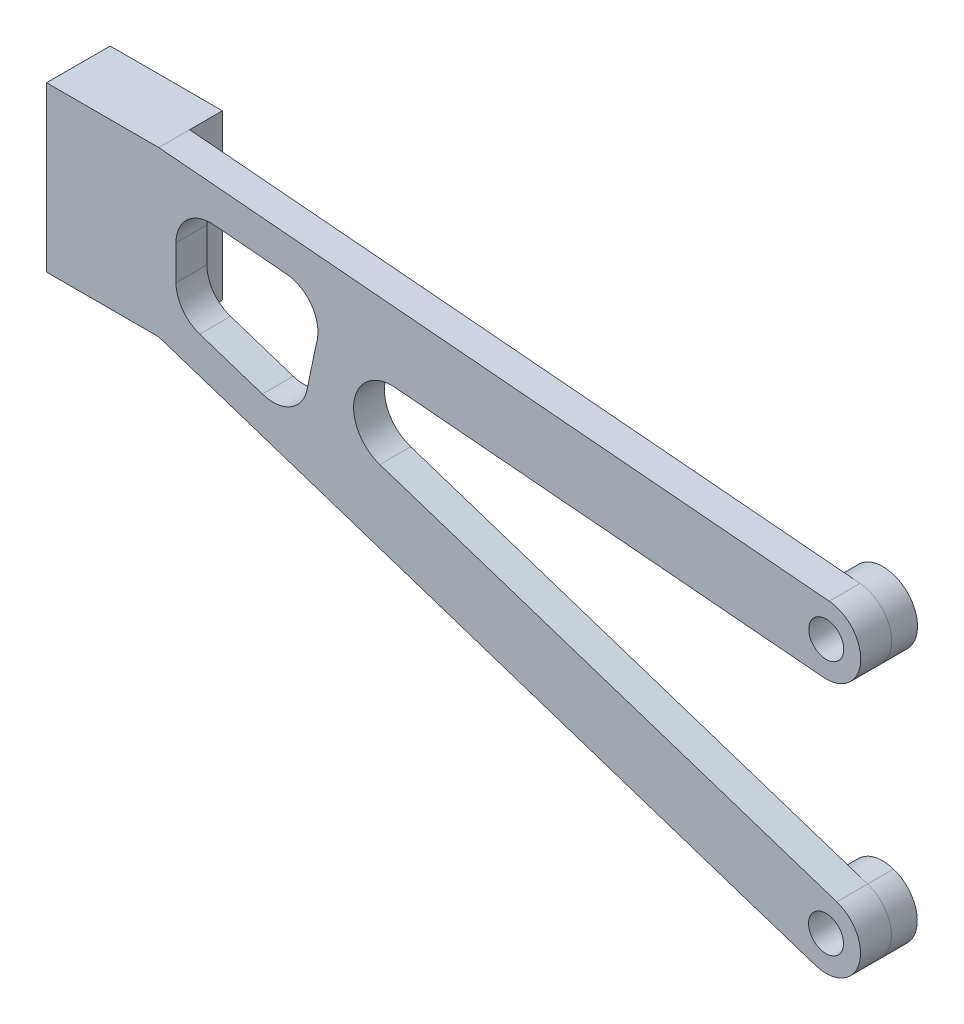
ISO-10303-21;
HEADER;
FILE_DESCRIPTION(('STEP AP214'),'2;1');
FILE_NAME('part.step','',(''),(''),'','','');
FILE_SCHEMA(('AUTOMOTIVE_DESIGN { 1 0 10303 214 1 1 1 1 }'));
ENDSEC;
DATA;
#1=APPLICATION_CONTEXT('core data for automotive mechanical design processes');
#2=APPLICATION_PROTOCOL_DEFINITION('international standard','automotive_design',2000,#1);
#3=PRODUCT_CONTEXT('',#1,'mechanical');
#4=PRODUCT('Part','Part','',(#3));
#5=PRODUCT_RELATED_PRODUCT_CATEGORY('part','',(#4));
#6=PRODUCT_DEFINITION_FORMATION('','',#4);
#7=PRODUCT_DEFINITION_CONTEXT('part definition',#1,'design');
#8=PRODUCT_DEFINITION('design','',#6,#7);
#9=PRODUCT_DEFINITION_SHAPE('','',#8);
#10=(LENGTH_UNIT() NAMED_UNIT(*) SI_UNIT(.MILLI.,.METRE.));
#11=(NAMED_UNIT(*) PLANE_ANGLE_UNIT() SI_UNIT($,.RADIAN.));
#12=(NAMED_UNIT(*) SI_UNIT($,.STERADIAN.) SOLID_ANGLE_UNIT());
#13=UNCERTAINTY_MEASURE_WITH_UNIT(LENGTH_MEASURE(1.E-05),#10,'distance_accuracy_value','');
#14=(GEOMETRIC_REPRESENTATION_CONTEXT(3) GLOBAL_UNCERTAINTY_ASSIGNED_CONTEXT((#13)) GLOBAL_UNIT_ASSIGNED_CONTEXT((#10,
#11,#12)) REPRESENTATION_CONTEXT('',''));
#15=CARTESIAN_POINT('',(0.,0.,0.));
#16=DIRECTION('',(0.,0.,1.));
#17=DIRECTION('',(1.,0.,0.));
#18=AXIS2_PLACEMENT_3D('',#15,#16,#17);
#19=CARTESIAN_POINT('',(90.3351419199884,8.33209639340714,0.));
#20=DIRECTION('',(0.,0.,-1.));
#21=DIRECTION('',(-1.,0.,0.));
#22=AXIS2_PLACEMENT_3D('',#19,#20,#21);
#23=PLANE('',#22);
#24=CARTESIAN_POINT('',(90.3351419199884,8.33209639340714,0.));
#25=DIRECTION('',(0.,0.,1.));
#26=DIRECTION('',(1.,0.,0.));
#27=AXIS2_PLACEMENT_3D('',#24,#25,#26);
#28=CIRCLE('',#27,2.02499999999999);
#29=CARTESIAN_POINT('',(92.3601419199884,8.33209639340714,0.));
#30=VERTEX_POINT('',#29);
#31=EDGE_CURVE('E503',#30,#30,#28,.T.);
#32=ORIENTED_EDGE('',*,*,#31,.T.);
#33=EDGE_LOOP('',(#32));
#34=FACE_BOUND('',#33,.T.);
#35=CARTESIAN_POINT('',(90.3350999999822,8.3321,0.));
#36=DIRECTION('',(0.,0.,-1.));
#37=DIRECTION('',(-1.,0.,0.));
#38=AXIS2_PLACEMENT_3D('',#35,#36,#37);
#39=CIRCLE('',#38,4.00000000000001);
#40=CARTESIAN_POINT('',(86.3350999999822,8.3321,0.));
#41=VERTEX_POINT('',#40);
#42=EDGE_CURVE('E43',#41,#41,#39,.T.);
#43=ORIENTED_EDGE('',*,*,#42,.T.);
#44=EDGE_LOOP('',(#43));
#45=FACE_BOUND('',#44,.T.);
#46=ADVANCED_FACE('F39',(#34,#45),#23,.T.);
#47=CARTESIAN_POINT('',(90.3098654104279,-21.2081872750437,0.));
#48=DIRECTION('',(0.,0.,1.));
#49=DIRECTION('',(1.,0.,0.));
#50=AXIS2_PLACEMENT_3D('',#47,#48,#49);
#51=CIRCLE('',#50,2.02499999999999);
#52=CARTESIAN_POINT('',(92.3348654104279,-21.2081872750437,0.));
#53=VERTEX_POINT('',#52);
#54=EDGE_CURVE('E492',#53,#53,#51,.T.);
#55=ORIENTED_EDGE('',*,*,#54,.T.);
#56=EDGE_LOOP('',(#55));
#57=FACE_BOUND('',#56,.T.);
#58=DIRECTION('',(-0.949969653728772,0.312342211355488,0.));
#59=VECTOR('',#58,1.);
#60=CARTESIAN_POINT('',(91.5592342558498,-17.4083086601286,0.));
#61=LINE('',#60,#59);
#62=CARTESIAN_POINT('',(91.5592342558498,-17.4083086601286,0.));
#63=VERTEX_POINT('',#62);
#64=CARTESIAN_POINT('',(91.5589688454041,-17.4082213850849,0.));
#65=VERTEX_POINT('',#64);
#66=EDGE_CURVE('E434',#63,#65,#61,.T.);
#67=ORIENTED_EDGE('',*,*,#66,.F.);
#68=CARTESIAN_POINT('',(90.3095999999822,-21.2081,0.));
#69=DIRECTION('',(0.,0.,-1.));
#70=DIRECTION('',(-1.,0.,0.));
#71=AXIS2_PLACEMENT_3D('',#68,#69,#70);
#72=CIRCLE('',#71,4.00000000000001);
#73=CARTESIAN_POINT('',(89.0604965711,-25.0080658714197,0.));
#74=VERTEX_POINT('',#73);
#75=EDGE_CURVE('E270',#63,#74,#72,.T.);
#76=ORIENTED_EDGE('',*,*,#75,.T.);
#77=DIRECTION('',(0.949969653728772,-0.312342211355488,0.));
#78=VECTOR('',#77,1.);
#79=CARTESIAN_POINT('',(13.,0.,0.));
#80=LINE('',#79,#78);
#81=CARTESIAN_POINT('',(89.0602311545602,-25.0079786149151,0.));
#82=VERTEX_POINT('',#81);
#83=EDGE_CURVE('E431',#82,#74,#80,.T.);
#84=ORIENTED_EDGE('',*,*,#83,.F.);
#85=EDGE_CURVE('E264',#82,#65,#72,.T.);
#86=ORIENTED_EDGE('',*,*,#85,.T.);
#87=EDGE_LOOP('',(#67,#76,#84,#86));
#88=FACE_BOUND('',#87,.T.);
#89=ADVANCED_FACE('F583',(#57,#88),#23,.T.);
#90=CARTESIAN_POINT('',(90.3351419199884,8.33209639340714,6.575));
#91=DIRECTION('',(0.,0.,-1.));
#92=DIRECTION('',(-1.,0.,0.));
#93=AXIS2_PLACEMENT_3D('',#90,#91,#92);
#94=PLANE('',#93);
#95=DIRECTION('',(-1.,0.,0.));
#96=VECTOR('',#95,1.);
#97=CARTESIAN_POINT('',(0.,19.,6.575));
#98=LINE('',#97,#96);
#99=CARTESIAN_POINT('',(13.,19.,6.575));
#100=VERTEX_POINT('',#99);
#101=CARTESIAN_POINT('',(0.,19.,6.575));
#102=VERTEX_POINT('',#101);
#103=EDGE_CURVE('E397',#100,#102,#98,.T.);
#104=ORIENTED_EDGE('',*,*,#103,.T.);
#105=DIRECTION('',(0.,-1.,0.));
#106=VECTOR('',#105,1.);
#107=CARTESIAN_POINT('',(0.,19.,6.575));
#108=LINE('',#107,#106);
#109=CARTESIAN_POINT('',(0.,0.,6.575));
#110=VERTEX_POINT('',#109);
#111=EDGE_CURVE('E214',#102,#110,#108,.T.);
#112=ORIENTED_EDGE('',*,*,#111,.T.);
#113=DIRECTION('',(1.,0.,0.));
#114=VECTOR('',#113,1.);
#115=CARTESIAN_POINT('',(0.,0.,6.575));
#116=LINE('',#115,#114);
#117=CARTESIAN_POINT('',(13.,0.,6.575));
#118=VERTEX_POINT('',#117);
#119=EDGE_CURVE('E402',#110,#118,#116,.T.);
#120=ORIENTED_EDGE('',*,*,#119,.T.);
#121=DIRECTION('',(0.949969653728772,-0.312342211355488,0.));
#122=VECTOR('',#121,1.);
#123=CARTESIAN_POINT('',(13.,0.,6.575));
#124=LINE('',#123,#122);
#125=CARTESIAN_POINT('',(89.0604965650059,-25.0080658899588,6.575));
#126=VERTEX_POINT('',#125);
#127=EDGE_CURVE('E405',#118,#126,#124,.T.);
#128=ORIENTED_EDGE('',*,*,#127,.T.);
#129=CARTESIAN_POINT('',(90.3098654104279,-21.2081872750437,6.575));
#130=DIRECTION('',(0.,0.,1.));
#131=DIRECTION('',(-1.,0.,0.));
#132=AXIS2_PLACEMENT_3D('',#129,#130,#131);
#133=CIRCLE('',#132,4.);
#134=CARTESIAN_POINT('',(91.5592342558498,-17.4083086601286,6.575));
#135=VERTEX_POINT('',#134);
#136=EDGE_CURVE('E408',#126,#135,#133,.T.);
#137=ORIENTED_EDGE('',*,*,#136,.T.);
#138=DIRECTION('',(-0.949969653728772,0.312342211355488,0.));
#139=VECTOR('',#138,1.);
#140=CARTESIAN_POINT('',(91.5592342558498,-17.4083086601286,6.575));
#141=LINE('',#140,#139);
#142=CARTESIAN_POINT('',(38.6172306352684,-0.00141316663960361,6.575));
#143=VERTEX_POINT('',#142);
#144=EDGE_CURVE('E411',#135,#143,#141,.T.);
#145=ORIENTED_EDGE('',*,*,#144,.T.);
#146=CARTESIAN_POINT('',(40.,4.2041949351286,6.575));
#147=DIRECTION('',(0.,0.,-1.));
#148=DIRECTION('',(1.,0.,0.));
#149=AXIS2_PLACEMENT_3D('',#146,#147,#148);
#150=CIRCLE('',#149,4.42709731333055);
#151=CARTESIAN_POINT('',(40.3794607710835,8.61499986676038,6.575));
#152=VERTEX_POINT('',#151);
#153=EDGE_CURVE('E414',#143,#152,#150,.T.);
#154=ORIENTED_EDGE('',*,*,#153,.T.);
#155=DIRECTION('',(0.996319850108173,-0.0857132211530312,0.));
#156=VECTOR('',#155,1.);
#157=CARTESIAN_POINT('',(40.3794607710835,8.61499986676038,6.575));
#158=LINE('',#157,#156);
#159=CARTESIAN_POINT('',(89.9922890353763,4.34681699297444,6.575));
#160=VERTEX_POINT('',#159);
#161=EDGE_CURVE('E417',#152,#160,#158,.T.);
#162=ORIENTED_EDGE('',*,*,#161,.T.);
#163=CARTESIAN_POINT('',(90.3351419199884,8.33209639340714,6.575));
#164=DIRECTION('',(0.,0.,1.));
#165=DIRECTION('',(-1.,0.,0.));
#166=AXIS2_PLACEMENT_3D('',#163,#164,#165);
#167=CIRCLE('',#166,4.00000000000001);
#168=CARTESIAN_POINT('',(90.6779948046005,12.3173757938398,6.575));
#169=VERTEX_POINT('',#168);
#170=EDGE_CURVE('E420',#160,#169,#167,.T.);
#171=ORIENTED_EDGE('',*,*,#170,.T.);
#172=DIRECTION('',(-0.996319850108173,0.0857132211530312,0.));
#173=VECTOR('',#172,1.);
#174=CARTESIAN_POINT('',(13.,19.,6.575));
#175=LINE('',#174,#173);
#176=EDGE_CURVE('E423',#169,#100,#175,.T.);
#177=ORIENTED_EDGE('',*,*,#176,.T.);
#178=EDGE_LOOP('',(#104,#112,#120,#128,#137,#145,#154,#162,#171,#177));
#179=FACE_BOUND('',#178,.T.);
#180=CARTESIAN_POINT('',(26.2467810472205,4.06588894625047,6.575));
#181=DIRECTION('',(0.,0.,1.));
#182=DIRECTION('',(1.,0.,0.));
#183=AXIS2_PLACEMENT_3D('',#180,#181,#182);
#184=CIRCLE('',#183,4.);
#185=CARTESIAN_POINT('',(24.9974122017985,0.266010331335376,6.575));
#186=VERTEX_POINT('',#185);
#187=CARTESIAN_POINT('',(30.16022559048,3.23827079345772,6.575));
#188=VERTEX_POINT('',#187);
#189=EDGE_CURVE('E510',#186,#188,#184,.T.);
#190=ORIENTED_EDGE('',*,*,#189,.F.);
#191=DIRECTION('',(0.949969653728772,-0.312342211355488,0.));
#192=VECTOR('',#191,1.);
#193=CARTESIAN_POINT('',(17.7506311545781,2.64869235555941,6.575));
#194=LINE('',#193,#192);
#195=CARTESIAN_POINT('',(17.750631154578,2.6486923555594,6.575));
#196=VERTEX_POINT('',#195);
#197=EDGE_CURVE('E364',#196,#186,#194,.T.);
#198=ORIENTED_EDGE('',*,*,#197,.F.);
#199=CARTESIAN_POINT('',(19.,6.4485709704745,6.575));
#200=DIRECTION('',(0.,0.,1.));
#201=DIRECTION('',(1.,0.,0.));
#202=AXIS2_PLACEMENT_3D('',#199,#200,#201);
#203=CIRCLE('',#202,4.);
#204=CARTESIAN_POINT('',(15.,6.4485709704745,6.575));
#205=VERTEX_POINT('',#204);
#206=EDGE_CURVE('E372',#205,#196,#203,.T.);
#207=ORIENTED_EDGE('',*,*,#206,.F.);
#208=DIRECTION('',(0.,-1.,0.));
#209=VECTOR('',#208,1.);
#210=CARTESIAN_POINT('',(15.,10.4542711098311,6.575));
#211=LINE('',#210,#209);
#212=CARTESIAN_POINT('',(15.,10.4542711098311,6.575));
#213=VERTEX_POINT('',#212);
#214=EDGE_CURVE('E528',#213,#205,#211,.T.);
#215=ORIENTED_EDGE('',*,*,#214,.F.);
#216=CARTESIAN_POINT('',(19.,10.4542711098311,6.575));
#217=DIRECTION('',(0.,0.,1.));
#218=DIRECTION('',(-1.,0.,0.));
#219=AXIS2_PLACEMENT_3D('',#216,#217,#218);
#220=CIRCLE('',#219,4.);
#221=CARTESIAN_POINT('',(19.3428528846121,14.4395505102638,6.575));
#222=VERTEX_POINT('',#221);
#223=EDGE_CURVE('E525',#222,#213,#220,.T.);
#224=ORIENTED_EDGE('',*,*,#223,.F.);
#225=DIRECTION('',(-0.996319850108173,0.0857132211530309,0.));
#226=VECTOR('',#225,1.);
#227=CARTESIAN_POINT('',(27.7870234358858,13.7131000056024,6.575));
#228=LINE('',#227,#226);
#229=CARTESIAN_POINT('',(27.7870234358858,13.7131000056024,6.575));
#230=VERTEX_POINT('',#229);
#231=EDGE_CURVE('E522',#230,#222,#228,.T.);
#232=ORIENTED_EDGE('',*,*,#231,.F.);
#233=CARTESIAN_POINT('',(27.4441705512737,9.72782060516968,6.575));
#234=DIRECTION('',(0.,0.,1.));
#235=DIRECTION('',(1.,0.,0.));
#236=AXIS2_PLACEMENT_3D('',#233,#234,#235);
#237=CIRCLE('',#236,4.);
#238=CARTESIAN_POINT('',(31.3576150945333,8.90020245237694,6.575));
#239=VERTEX_POINT('',#238);
#240=EDGE_CURVE('E519',#239,#230,#237,.T.);
#241=ORIENTED_EDGE('',*,*,#240,.F.);
#242=DIRECTION('',(0.206904538198186,0.978361135814887,0.));
#243=VECTOR('',#242,1.);
#244=CARTESIAN_POINT('',(30.16022559048,3.23827079345772,6.575));
#245=LINE('',#244,#243);
#246=EDGE_CURVE('E516',#188,#239,#245,.T.);
#247=ORIENTED_EDGE('',*,*,#246,.F.);
#248=EDGE_LOOP('',(#190,#198,#207,#215,#224,#232,#241,#247));
#249=FACE_BOUND('',#248,.T.);
#250=CARTESIAN_POINT('',(90.3351419199884,8.33209639340714,6.575));
#251=DIRECTION('',(0.,0.,1.));
#252=DIRECTION('',(1.,0.,0.));
#253=AXIS2_PLACEMENT_3D('',#250,#251,#252);
#254=CIRCLE('',#253,2.02499999999999);
#255=CARTESIAN_POINT('',(92.3601419199884,8.33209639340714,6.575));
#256=VERTEX_POINT('',#255);
#257=EDGE_CURVE('E506',#256,#256,#254,.T.);
#258=ORIENTED_EDGE('',*,*,#257,.F.);
#259=EDGE_LOOP('',(#258));
#260=FACE_BOUND('',#259,.T.);
#261=CARTESIAN_POINT('',(90.3098654104279,-21.2081872750437,6.575));
#262=DIRECTION('',(0.,0.,1.));
#263=DIRECTION('',(1.,0.,0.));
#264=AXIS2_PLACEMENT_3D('',#261,#262,#263);
#265=CIRCLE('',#264,2.02499999999999);
#266=CARTESIAN_POINT('',(92.3348654104279,-21.2081872750437,6.575));
#267=VERTEX_POINT('',#266);
#268=EDGE_CURVE('E497',#267,#267,#265,.T.);
#269=ORIENTED_EDGE('',*,*,#268,.F.);
#270=EDGE_LOOP('',(#269));
#271=FACE_BOUND('',#270,.T.);
#272=ADVANCED_FACE('F538',(#179,#249,#260,#271),#94,.F.);
#273=DIRECTION('',(-1.,0.,0.));
#274=VECTOR('',#273,1.);
#275=CARTESIAN_POINT('',(10.5,16.5,0.));
#276=LINE('',#275,#274);
#277=CARTESIAN_POINT('',(10.5,16.5,0.));
#278=VERTEX_POINT('',#277);
#279=CARTESIAN_POINT('',(0.,16.5,0.));
#280=VERTEX_POINT('',#279);
#281=EDGE_CURVE('E236',#278,#280,#276,.T.);
#282=ORIENTED_EDGE('',*,*,#281,.F.);
#283=DIRECTION('',(0.,1.,0.));
#284=VECTOR('',#283,1.);
#285=CARTESIAN_POINT('',(10.5,0.,0.));
#286=LINE('',#285,#284);
#287=CARTESIAN_POINT('',(10.5,0.,0.));
#288=VERTEX_POINT('',#287);
#289=EDGE_CURVE('E62',#288,#278,#286,.T.);
#290=ORIENTED_EDGE('',*,*,#289,.F.);
#291=DIRECTION('',(1.,0.,0.));
#292=VECTOR('',#291,1.);
#293=CARTESIAN_POINT('',(0.,0.,0.));
#294=LINE('',#293,#292);
#295=CARTESIAN_POINT('',(0.,0.,0.));
#296=VERTEX_POINT('',#295);
#297=EDGE_CURVE('E428',#296,#288,#294,.T.);
#298=ORIENTED_EDGE('',*,*,#297,.F.);
#299=DIRECTION('',(0.,-1.,0.));
#300=VECTOR('',#299,1.);
#301=CARTESIAN_POINT('',(0.,19.,0.));
#302=LINE('',#301,#300);
#303=EDGE_CURVE('E57',#280,#296,#302,.T.);
#304=ORIENTED_EDGE('',*,*,#303,.F.);
#305=EDGE_LOOP('',(#282,#290,#298,#304));
#306=FACE_BOUND('',#305,.T.);
#307=ADVANCED_FACE('F604',(#306),#23,.T.);
#308=CARTESIAN_POINT('',(0.,19.,6.575));
#309=DIRECTION('',(0.,-1.,0.));
#310=DIRECTION('',(0.,0.,-1.));
#311=AXIS2_PLACEMENT_3D('',#308,#309,#310);
#312=PLANE('',#311);
#313=DIRECTION('',(0.,0.,-1.));
#314=VECTOR('',#313,1.);
#315=CARTESIAN_POINT('',(13.,19.,3.));
#316=LINE('',#315,#314);
#317=CARTESIAN_POINT('',(13.,19.,3.));
#318=VERTEX_POINT('',#317);
#319=CARTESIAN_POINT('',(13.,19.,-0.8));
#320=VERTEX_POINT('',#319);
#321=EDGE_CURVE('E224',#318,#320,#316,.T.);
#322=ORIENTED_EDGE('',*,*,#321,.T.);
#323=DIRECTION('',(1.,0.,0.));
#324=VECTOR('',#323,1.);
#325=CARTESIAN_POINT('',(0.,19.,-0.8));
#326=LINE('',#325,#324);
#327=CARTESIAN_POINT('',(0.,19.,-0.8));
#328=VERTEX_POINT('',#327);
#329=EDGE_CURVE('E222',#328,#320,#326,.T.);
#330=ORIENTED_EDGE('',*,*,#329,.F.);
#331=DIRECTION('',(0.,0.,-1.));
#332=VECTOR('',#331,1.);
#333=CARTESIAN_POINT('',(0.,19.,6.575));
#334=LINE('',#333,#332);
#335=EDGE_CURVE('E207',#102,#328,#334,.T.);
#336=ORIENTED_EDGE('',*,*,#335,.F.);
#337=ORIENTED_EDGE('',*,*,#103,.F.);
#338=DIRECTION('',(0.,0.,-1.));
#339=VECTOR('',#338,1.);
#340=CARTESIAN_POINT('',(13.,19.,6.575));
#341=LINE('',#340,#339);
#342=EDGE_CURVE('E305',#100,#318,#341,.T.);
#343=ORIENTED_EDGE('',*,*,#342,.T.);
#344=EDGE_LOOP('',(#322,#330,#336,#337,#343));
#345=FACE_BOUND('',#344,.T.);
#346=ADVANCED_FACE('F41',(#345),#312,.F.);
#347=CARTESIAN_POINT('',(0.,19.,6.575));
#348=DIRECTION('',(1.,0.,0.));
#349=DIRECTION('',(0.,1.,0.));
#350=AXIS2_PLACEMENT_3D('',#347,#348,#349);
#351=PLANE('',#350);
#352=ORIENTED_EDGE('',*,*,#335,.T.);
#353=DIRECTION('',(0.,1.,0.));
#354=VECTOR('',#353,1.);
#355=CARTESIAN_POINT('',(0.,16.5,-0.8));
#356=LINE('',#355,#354);
#357=CARTESIAN_POINT('',(0.,16.5,-0.8));
#358=VERTEX_POINT('',#357);
#359=EDGE_CURVE('E212',#358,#328,#356,.T.);
#360=ORIENTED_EDGE('',*,*,#359,.F.);
#361=DIRECTION('',(0.,0.,1.));
#362=VECTOR('',#361,1.);
#363=CARTESIAN_POINT('',(0.,16.5,-0.8));
#364=LINE('',#363,#362);
#365=EDGE_CURVE('E251',#358,#280,#364,.T.);
#366=ORIENTED_EDGE('',*,*,#365,.T.);
#367=ORIENTED_EDGE('',*,*,#303,.T.);
#368=DIRECTION('',(0.,0.,-1.));
#369=VECTOR('',#368,1.);
#370=CARTESIAN_POINT('',(0.,0.,6.575));
#371=LINE('',#370,#369);
#372=EDGE_CURVE('E219',#110,#296,#371,.T.);
#373=ORIENTED_EDGE('',*,*,#372,.F.);
#374=ORIENTED_EDGE('',*,*,#111,.F.);
#375=EDGE_LOOP('',(#352,#360,#366,#367,#373,#374));
#376=FACE_BOUND('',#375,.T.);
#377=ADVANCED_FACE('F209',(#376),#351,.F.);
#378=CARTESIAN_POINT('',(0.,0.,6.575));
#379=DIRECTION('',(0.,1.,0.));
#380=DIRECTION('',(0.,0.,1.));
#381=AXIS2_PLACEMENT_3D('',#378,#379,#380);
#382=PLANE('',#381);
#383=ORIENTED_EDGE('',*,*,#297,.T.);
#384=DIRECTION('',(0.,0.,1.));
#385=VECTOR('',#384,1.);
#386=CARTESIAN_POINT('',(10.5,0.,-0.8));
#387=LINE('',#386,#385);
#388=CARTESIAN_POINT('',(10.5,0.,-0.8));
#389=VERTEX_POINT('',#388);
#390=EDGE_CURVE('E260',#389,#288,#387,.T.);
#391=ORIENTED_EDGE('',*,*,#390,.F.);
#392=DIRECTION('',(-1.,0.,0.));
#393=VECTOR('',#392,1.);
#394=CARTESIAN_POINT('',(13.,0.,-0.8));
#395=LINE('',#394,#393);
#396=CARTESIAN_POINT('',(13.,0.,-0.8));
#397=VERTEX_POINT('',#396);
#398=EDGE_CURVE('E243',#397,#389,#395,.T.);
#399=ORIENTED_EDGE('',*,*,#398,.F.);
#400=DIRECTION('',(0.,0.,1.));
#401=VECTOR('',#400,1.);
#402=CARTESIAN_POINT('',(13.,0.,6.575));
#403=LINE('',#402,#401);
#404=CARTESIAN_POINT('',(13.,0.,3.));
#405=VERTEX_POINT('',#404);
#406=EDGE_CURVE('E486',#397,#405,#403,.T.);
#407=ORIENTED_EDGE('',*,*,#406,.T.);
#408=DIRECTION('',(0.,0.,-1.));
#409=VECTOR('',#408,1.);
#410=CARTESIAN_POINT('',(13.,0.,6.575));
#411=LINE('',#410,#409);
#412=EDGE_CURVE('E331',#118,#405,#411,.T.);
#413=ORIENTED_EDGE('',*,*,#412,.F.);
#414=ORIENTED_EDGE('',*,*,#119,.F.);
#415=ORIENTED_EDGE('',*,*,#372,.T.);
#416=EDGE_LOOP('',(#383,#391,#399,#407,#413,#414,#415));
#417=FACE_BOUND('',#416,.T.);
#418=ADVANCED_FACE('F590',(#417),#382,.F.);
#419=CARTESIAN_POINT('',(13.,0.,6.575));
#420=DIRECTION('',(0.312342211355488,0.949969653728772,0.));
#421=DIRECTION('',(-0.949969653728773,0.312342211355488,0.));
#422=AXIS2_PLACEMENT_3D('',#419,#420,#421);
#423=PLANE('',#422);
#424=ORIENTED_EDGE('',*,*,#412,.T.);
#425=DIRECTION('',(0.949969653728773,-0.312342211355488,0.));
#426=VECTOR('',#425,1.);
#427=CARTESIAN_POINT('',(13.,0.,3.));
#428=LINE('',#427,#426);
#429=CARTESIAN_POINT('',(89.0602311545602,-25.0079786149151,3.));
#430=VERTEX_POINT('',#429);
#431=EDGE_CURVE('E482',#405,#430,#428,.T.);
#432=ORIENTED_EDGE('',*,*,#431,.T.);
#433=DIRECTION('',(0.,0.,-1.));
#434=VECTOR('',#433,1.);
#435=CARTESIAN_POINT('',(89.0602311530364,-25.0079786195497,3.));
#436=LINE('',#435,#434);
#437=EDGE_CURVE('E489',#430,#82,#436,.T.);
#438=ORIENTED_EDGE('',*,*,#437,.T.);
#439=ORIENTED_EDGE('',*,*,#83,.T.);
#440=DIRECTION('',(0.,0.,-1.));
#441=VECTOR('',#440,1.);
#442=CARTESIAN_POINT('',(89.0604965650059,-25.0080658899588,6.575));
#443=LINE('',#442,#441);
#444=CARTESIAN_POINT('',(89.0604965711,-25.0080658714197,3.));
#445=VERTEX_POINT('',#444);
#446=EDGE_CURVE('E326',#445,#74,#443,.T.);
#447=ORIENTED_EDGE('',*,*,#446,.F.);
#448=EDGE_CURVE('E327',#126,#445,#443,.T.);
#449=ORIENTED_EDGE('',*,*,#448,.F.);
#450=ORIENTED_EDGE('',*,*,#127,.F.);
#451=EDGE_LOOP('',(#424,#432,#438,#439,#447,#449,#450));
#452=FACE_BOUND('',#451,.T.);
#453=ADVANCED_FACE('F585',(#452),#423,.F.);
#454=CARTESIAN_POINT('',(90.3098654104279,-21.2081872750437,6.575));
#455=DIRECTION('',(0.,0.,-1.));
#456=DIRECTION('',(-1.,0.,0.));
#457=AXIS2_PLACEMENT_3D('',#454,#455,#456);
#458=CYLINDRICAL_SURFACE('',#457,4.);
#459=ORIENTED_EDGE('',*,*,#448,.T.);
#460=CARTESIAN_POINT('',(90.3098654104279,-21.2081872750437,3.));
#461=DIRECTION('',(0.,0.,1.));
#462=DIRECTION('',(1.,0.,0.));
#463=AXIS2_PLACEMENT_3D('',#460,#461,#462);
#464=CIRCLE('',#463,4.);
#465=CARTESIAN_POINT('',(91.5592342558498,-17.4083086601286,3.));
#466=VERTEX_POINT('',#465);
#467=EDGE_CURVE('E475',#445,#466,#464,.T.);
#468=ORIENTED_EDGE('',*,*,#467,.T.);
#469=DIRECTION('',(0.,0.,-1.));
#470=VECTOR('',#469,1.);
#471=CARTESIAN_POINT('',(91.5592342558498,-17.4083086601286,6.575));
#472=LINE('',#471,#470);
#473=EDGE_CURVE('E322',#135,#466,#472,.T.);
#474=ORIENTED_EDGE('',*,*,#473,.F.);
#475=ORIENTED_EDGE('',*,*,#136,.F.);
#476=EDGE_LOOP('',(#459,#468,#474,#475));
#477=FACE_BOUND('',#476,.T.);
#478=ADVANCED_FACE('F589',(#477),#458,.T.);
#479=CARTESIAN_POINT('',(91.5592342558498,-17.4083086601286,6.575));
#480=DIRECTION('',(-0.312342211355488,-0.949969653728772,0.));
#481=DIRECTION('',(0.949969653728773,-0.312342211355488,0.));
#482=AXIS2_PLACEMENT_3D('',#479,#480,#481);
#483=PLANE('',#482);
#484=ORIENTED_EDGE('',*,*,#473,.T.);
#485=EDGE_CURVE('E321',#466,#63,#472,.T.);
#486=ORIENTED_EDGE('',*,*,#485,.T.);
#487=ORIENTED_EDGE('',*,*,#66,.T.);
#488=DIRECTION('',(0.,0.,-1.));
#489=VECTOR('',#488,1.);
#490=CARTESIAN_POINT('',(91.5589688438803,-17.4082213897196,3.));
#491=LINE('',#490,#489);
#492=CARTESIAN_POINT('',(91.5589688454041,-17.4082213850849,3.));
#493=VERTEX_POINT('',#492);
#494=EDGE_CURVE('E11',#493,#65,#491,.T.);
#495=ORIENTED_EDGE('',*,*,#494,.F.);
#496=DIRECTION('',(-0.949969653728773,0.312342211355488,0.));
#497=VECTOR('',#496,1.);
#498=CARTESIAN_POINT('',(91.5592342558498,-17.4083086601286,3.));
#499=LINE('',#498,#497);
#500=CARTESIAN_POINT('',(38.6172306352684,-0.00141316663960361,3.));
#501=VERTEX_POINT('',#500);
#502=EDGE_CURVE('E472',#493,#501,#499,.T.);
#503=ORIENTED_EDGE('',*,*,#502,.T.);
#504=DIRECTION('',(0.,0.,-1.));
#505=VECTOR('',#504,1.);
#506=CARTESIAN_POINT('',(38.6172306352684,-0.00141316663960361,6.575));
#507=LINE('',#506,#505);
#508=EDGE_CURVE('E317',#143,#501,#507,.T.);
#509=ORIENTED_EDGE('',*,*,#508,.F.);
#510=ORIENTED_EDGE('',*,*,#144,.F.);
#511=EDGE_LOOP('',(#484,#486,#487,#495,#503,#509,#510));
#512=FACE_BOUND('',#511,.T.);
#513=ADVANCED_FACE('F596',(#512),#483,.F.);
#514=CARTESIAN_POINT('',(40.,4.2041949351286,6.575));
#515=DIRECTION('',(0.,0.,-1.));
#516=DIRECTION('',(-1.,0.,0.));
#517=AXIS2_PLACEMENT_3D('',#514,#515,#516);
#518=CYLINDRICAL_SURFACE('',#517,4.42709731333055);
#519=ORIENTED_EDGE('',*,*,#508,.T.);
#520=CARTESIAN_POINT('',(40.,4.2041949351286,3.));
#521=DIRECTION('',(0.,0.,1.));
#522=DIRECTION('',(1.,0.,0.));
#523=AXIS2_PLACEMENT_3D('',#520,#521,#522);
#524=CIRCLE('',#523,4.42709731333055);
#525=CARTESIAN_POINT('',(40.3794607710835,8.61499986676038,3.));
#526=VERTEX_POINT('',#525);
#527=EDGE_CURVE('E292',#501,#526,#524,.F.);
#528=ORIENTED_EDGE('',*,*,#527,.T.);
#529=DIRECTION('',(0.,0.,-1.));
#530=VECTOR('',#529,1.);
#531=CARTESIAN_POINT('',(40.3794607710835,8.61499986676038,6.575));
#532=LINE('',#531,#530);
#533=EDGE_CURVE('E313',#152,#526,#532,.T.);
#534=ORIENTED_EDGE('',*,*,#533,.F.);
#535=ORIENTED_EDGE('',*,*,#153,.F.);
#536=EDGE_LOOP('',(#519,#528,#534,#535));
#537=FACE_BOUND('',#536,.T.);
#538=ADVANCED_FACE('F468',(#537),#518,.F.);
#539=CARTESIAN_POINT('',(40.3794607710835,8.61499986676038,6.575));
#540=DIRECTION('',(0.0857132211530312,0.996319850108173,0.));
#541=DIRECTION('',(-0.996319850108173,0.0857132211530312,0.));
#542=AXIS2_PLACEMENT_3D('',#539,#540,#541);
#543=PLANE('',#542);
#544=ORIENTED_EDGE('',*,*,#533,.T.);
#545=DIRECTION('',(0.996319850108173,-0.0857132211530312,0.));
#546=VECTOR('',#545,1.);
#547=CARTESIAN_POINT('',(40.3794607710835,8.61499986676038,3.));
#548=LINE('',#547,#546);
#549=CARTESIAN_POINT('',(89.9922680753921,4.34681879649135,3.));
#550=VERTEX_POINT('',#549);
#551=EDGE_CURVE('E287',#526,#550,#548,.T.);
#552=ORIENTED_EDGE('',*,*,#551,.T.);
#553=DIRECTION('',(0.,0.,-1.));
#554=VECTOR('',#553,1.);
#555=CARTESIAN_POINT('',(89.9922890353763,4.34681699297444,6.575));
#556=LINE('',#555,#554);
#557=EDGE_CURVE('E304',#160,#550,#556,.T.);
#558=ORIENTED_EDGE('',*,*,#557,.F.);
#559=ORIENTED_EDGE('',*,*,#161,.F.);
#560=EDGE_LOOP('',(#544,#552,#558,#559));
#561=FACE_BOUND('',#560,.T.);
#562=ADVANCED_FACE('F462',(#561),#543,.F.);
#563=CARTESIAN_POINT('',(90.3351419199884,8.33209639340714,6.575));
#564=DIRECTION('',(0.,0.,-1.));
#565=DIRECTION('',(-1.,0.,0.));
#566=AXIS2_PLACEMENT_3D('',#563,#564,#565);
#567=CYLINDRICAL_SURFACE('',#566,4.00000000000001);
#568=ORIENTED_EDGE('',*,*,#557,.T.);
#569=CARTESIAN_POINT('',(90.3350999999822,8.3321,3.));
#570=DIRECTION('',(0.,0.,-1.));
#571=DIRECTION('',(0.0857184611549945,0.996319399297846,0.));
#572=AXIS2_PLACEMENT_3D('',#569,#570,#571);
#573=CIRCLE('',#572,4.00000000000001);
#574=CARTESIAN_POINT('',(90.6779738445974,12.3173775971363,3.));
#575=VERTEX_POINT('',#574);
#576=EDGE_CURVE('E293',#575,#550,#573,.T.);
#577=ORIENTED_EDGE('',*,*,#576,.F.);
#578=DIRECTION('',(0.,0.,-1.));
#579=VECTOR('',#578,1.);
#580=CARTESIAN_POINT('',(90.6779948046005,12.3173757938398,6.575));
#581=LINE('',#580,#579);
#582=EDGE_CURVE('E299',#169,#575,#581,.T.);
#583=ORIENTED_EDGE('',*,*,#582,.F.);
#584=ORIENTED_EDGE('',*,*,#170,.F.);
#585=EDGE_LOOP('',(#568,#577,#583,#584));
#586=FACE_BOUND('',#585,.T.);
#587=ADVANCED_FACE('F458',(#586),#567,.T.);
#588=CARTESIAN_POINT('',(13.,19.,6.575));
#589=DIRECTION('',(-0.0857132211530312,-0.996319850108173,0.));
#590=DIRECTION('',(0.996319850108173,-0.0857132211530312,0.));
#591=AXIS2_PLACEMENT_3D('',#588,#589,#590);
#592=PLANE('',#591);
#593=ORIENTED_EDGE('',*,*,#582,.T.);
#594=DIRECTION('',(-0.996319850108173,0.0857132211530312,0.));
#595=VECTOR('',#594,1.);
#596=CARTESIAN_POINT('',(13.,19.,3.));
#597=LINE('',#596,#595);
#598=EDGE_CURVE('E284',#575,#318,#597,.T.);
#599=ORIENTED_EDGE('',*,*,#598,.T.);
#600=ORIENTED_EDGE('',*,*,#342,.F.);
#601=ORIENTED_EDGE('',*,*,#176,.F.);
#602=EDGE_LOOP('',(#593,#599,#600,#601));
#603=FACE_BOUND('',#602,.T.);
#604=ADVANCED_FACE('F569',(#603),#592,.F.);
#605=CARTESIAN_POINT('',(26.2467810472205,4.06588894625047,6.575));
#606=DIRECTION('',(0.,0.,-1.));
#607=DIRECTION('',(-1.,0.,0.));
#608=AXIS2_PLACEMENT_3D('',#605,#606,#607);
#609=CYLINDRICAL_SURFACE('',#608,4.);
#610=CARTESIAN_POINT('',(26.2467810472205,4.06588894625047,3.));
#611=DIRECTION('',(0.,0.,1.));
#612=DIRECTION('',(1.,0.,0.));
#613=AXIS2_PLACEMENT_3D('',#610,#611,#612);
#614=CIRCLE('',#613,4.);
#615=CARTESIAN_POINT('',(24.9974122017985,0.266010331335375,3.));
#616=VERTEX_POINT('',#615);
#617=CARTESIAN_POINT('',(30.16022559048,3.23827079345772,3.));
#618=VERTEX_POINT('',#617);
#619=EDGE_CURVE('E344',#616,#618,#614,.T.);
#620=ORIENTED_EDGE('',*,*,#619,.F.);
#621=DIRECTION('',(0.,0.,-1.));
#622=VECTOR('',#621,1.);
#623=CARTESIAN_POINT('',(24.9974122017985,0.266010331335376,6.575));
#624=LINE('',#623,#622);
#625=EDGE_CURVE('E355',#186,#616,#624,.T.);
#626=ORIENTED_EDGE('',*,*,#625,.F.);
#627=ORIENTED_EDGE('',*,*,#189,.T.);
#628=DIRECTION('',(0.,0.,-1.));
#629=VECTOR('',#628,1.);
#630=CARTESIAN_POINT('',(30.16022559048,3.23827079345772,6.575));
#631=LINE('',#630,#629);
#632=EDGE_CURVE('E358',#188,#618,#631,.T.);
#633=ORIENTED_EDGE('',*,*,#632,.T.);
#634=EDGE_LOOP('',(#620,#626,#627,#633));
#635=FACE_BOUND('',#634,.T.);
#636=ADVANCED_FACE('F354',(#635),#609,.F.);
#637=CARTESIAN_POINT('',(30.16022559048,3.23827079345772,6.575));
#638=DIRECTION('',(-0.978361135814887,0.206904538198186,0.));
#639=DIRECTION('',(-0.206904538198186,-0.978361135814887,0.));
#640=AXIS2_PLACEMENT_3D('',#637,#638,#639);
#641=PLANE('',#640);
#642=DIRECTION('',(0.206904538198186,0.978361135814887,0.));
#643=VECTOR('',#642,1.);
#644=CARTESIAN_POINT('',(30.16022559048,3.23827079345772,3.));
#645=LINE('',#644,#643);
#646=CARTESIAN_POINT('',(31.3576150945333,8.90020245237694,3.));
#647=VERTEX_POINT('',#646);
#648=EDGE_CURVE('E360',#618,#647,#645,.T.);
#649=ORIENTED_EDGE('',*,*,#648,.F.);
#650=ORIENTED_EDGE('',*,*,#632,.F.);
#651=ORIENTED_EDGE('',*,*,#246,.T.);
#652=DIRECTION('',(0.,0.,-1.));
#653=VECTOR('',#652,1.);
#654=CARTESIAN_POINT('',(31.3576150945333,8.90020245237694,6.575));
#655=LINE('',#654,#653);
#656=EDGE_CURVE('E391',#239,#647,#655,.T.);
#657=ORIENTED_EDGE('',*,*,#656,.T.);
#658=EDGE_LOOP('',(#649,#650,#651,#657));
#659=FACE_BOUND('',#658,.T.);
#660=ADVANCED_FACE('F543',(#659),#641,.T.);
#661=CARTESIAN_POINT('',(27.4441705512737,9.72782060516968,6.575));
#662=DIRECTION('',(0.,0.,-1.));
#663=DIRECTION('',(-1.,0.,0.));
#664=AXIS2_PLACEMENT_3D('',#661,#662,#663);
#665=CYLINDRICAL_SURFACE('',#664,4.);
#666=CARTESIAN_POINT('',(27.4441705512737,9.72782060516968,3.));
#667=DIRECTION('',(0.,0.,1.));
#668=DIRECTION('',(1.,0.,0.));
#669=AXIS2_PLACEMENT_3D('',#666,#667,#668);
#670=CIRCLE('',#669,4.);
#671=CARTESIAN_POINT('',(27.7870234358858,13.7131000056024,3.));
#672=VERTEX_POINT('',#671);
#673=EDGE_CURVE('E547',#647,#672,#670,.T.);
#674=ORIENTED_EDGE('',*,*,#673,.F.);
#675=ORIENTED_EDGE('',*,*,#656,.F.);
#676=ORIENTED_EDGE('',*,*,#240,.T.);
#677=DIRECTION('',(0.,0.,-1.));
#678=VECTOR('',#677,1.);
#679=CARTESIAN_POINT('',(27.7870234358858,13.7131000056024,6.575));
#680=LINE('',#679,#678);
#681=EDGE_CURVE('E387',#230,#672,#680,.T.);
#682=ORIENTED_EDGE('',*,*,#681,.T.);
#683=EDGE_LOOP('',(#674,#675,#676,#682));
#684=FACE_BOUND('',#683,.T.);
#685=ADVANCED_FACE('F673',(#684),#665,.F.);
#686=CARTESIAN_POINT('',(27.7870234358858,13.7131000056024,6.575));
#687=DIRECTION('',(-0.085713221153031,-0.996319850108173,0.));
#688=DIRECTION('',(0.996319850108173,-0.085713221153031,0.));
#689=AXIS2_PLACEMENT_3D('',#686,#687,#688);
#690=PLANE('',#689);
#691=DIRECTION('',(-0.996319850108173,0.085713221153031,0.));
#692=VECTOR('',#691,1.);
#693=CARTESIAN_POINT('',(27.7870234358858,13.7131000056024,3.));
#694=LINE('',#693,#692);
#695=CARTESIAN_POINT('',(19.3428528846121,14.4395505102638,3.));
#696=VERTEX_POINT('',#695);
#697=EDGE_CURVE('E549',#672,#696,#694,.T.);
#698=ORIENTED_EDGE('',*,*,#697,.F.);
#699=ORIENTED_EDGE('',*,*,#681,.F.);
#700=ORIENTED_EDGE('',*,*,#231,.T.);
#701=DIRECTION('',(0.,0.,-1.));
#702=VECTOR('',#701,1.);
#703=CARTESIAN_POINT('',(19.3428528846121,14.4395505102638,6.575));
#704=LINE('',#703,#702);
#705=EDGE_CURVE('E383',#222,#696,#704,.T.);
#706=ORIENTED_EDGE('',*,*,#705,.T.);
#707=EDGE_LOOP('',(#698,#699,#700,#706));
#708=FACE_BOUND('',#707,.T.);
#709=ADVANCED_FACE('F669',(#708),#690,.T.);
#710=CARTESIAN_POINT('',(19.,10.4542711098311,6.575));
#711=DIRECTION('',(0.,0.,-1.));
#712=DIRECTION('',(-1.,0.,0.));
#713=AXIS2_PLACEMENT_3D('',#710,#711,#712);
#714=CYLINDRICAL_SURFACE('',#713,4.);
#715=CARTESIAN_POINT('',(19.,10.4542711098311,3.));
#716=DIRECTION('',(0.,0.,1.));
#717=DIRECTION('',(1.,0.,0.));
#718=AXIS2_PLACEMENT_3D('',#715,#716,#717);
#719=CIRCLE('',#718,4.);
#720=CARTESIAN_POINT('',(15.,10.4542711098311,3.));
#721=VERTEX_POINT('',#720);
#722=EDGE_CURVE('E554',#696,#721,#719,.T.);
#723=ORIENTED_EDGE('',*,*,#722,.F.);
#724=ORIENTED_EDGE('',*,*,#705,.F.);
#725=ORIENTED_EDGE('',*,*,#223,.T.);
#726=DIRECTION('',(0.,0.,-1.));
#727=VECTOR('',#726,1.);
#728=CARTESIAN_POINT('',(15.,10.4542711098311,6.575));
#729=LINE('',#728,#727);
#730=EDGE_CURVE('E379',#213,#721,#729,.T.);
#731=ORIENTED_EDGE('',*,*,#730,.T.);
#732=EDGE_LOOP('',(#723,#724,#725,#731));
#733=FACE_BOUND('',#732,.T.);
#734=ADVANCED_FACE('F665',(#733),#714,.F.);
#735=CARTESIAN_POINT('',(15.,10.4542711098311,6.575));
#736=DIRECTION('',(1.,0.,0.));
#737=DIRECTION('',(0.,1.,0.));
#738=AXIS2_PLACEMENT_3D('',#735,#736,#737);
#739=PLANE('',#738);
#740=DIRECTION('',(0.,-1.,0.));
#741=VECTOR('',#740,1.);
#742=CARTESIAN_POINT('',(15.,10.4542711098311,3.));
#743=LINE('',#742,#741);
#744=CARTESIAN_POINT('',(15.,6.4485709704745,3.));
#745=VERTEX_POINT('',#744);
#746=EDGE_CURVE('E557',#721,#745,#743,.T.);
#747=ORIENTED_EDGE('',*,*,#746,.F.);
#748=ORIENTED_EDGE('',*,*,#730,.F.);
#749=ORIENTED_EDGE('',*,*,#214,.T.);
#750=DIRECTION('',(0.,0.,-1.));
#751=VECTOR('',#750,1.);
#752=CARTESIAN_POINT('',(15.,6.4485709704745,6.575));
#753=LINE('',#752,#751);
#754=EDGE_CURVE('E370',#205,#745,#753,.T.);
#755=ORIENTED_EDGE('',*,*,#754,.T.);
#756=EDGE_LOOP('',(#747,#748,#749,#755));
#757=FACE_BOUND('',#756,.T.);
#758=ADVANCED_FACE('F662',(#757),#739,.T.);
#759=CARTESIAN_POINT('',(19.,6.4485709704745,6.575));
#760=DIRECTION('',(0.,0.,-1.));
#761=DIRECTION('',(-1.,0.,0.));
#762=AXIS2_PLACEMENT_3D('',#759,#760,#761);
#763=CYLINDRICAL_SURFACE('',#762,4.);
#764=CARTESIAN_POINT('',(19.,6.4485709704745,3.));
#765=DIRECTION('',(0.,0.,1.));
#766=DIRECTION('',(1.,0.,0.));
#767=AXIS2_PLACEMENT_3D('',#764,#765,#766);
#768=CIRCLE('',#767,4.);
#769=CARTESIAN_POINT('',(17.7506311545781,2.64869235555941,3.));
#770=VERTEX_POINT('',#769);
#771=EDGE_CURVE('E347',#745,#770,#768,.T.);
#772=ORIENTED_EDGE('',*,*,#771,.F.);
#773=ORIENTED_EDGE('',*,*,#754,.F.);
#774=ORIENTED_EDGE('',*,*,#206,.T.);
#775=DIRECTION('',(0.,0.,-1.));
#776=VECTOR('',#775,1.);
#777=CARTESIAN_POINT('',(17.7506311545781,2.64869235555941,6.575));
#778=LINE('',#777,#776);
#779=EDGE_CURVE('E366',#196,#770,#778,.T.);
#780=ORIENTED_EDGE('',*,*,#779,.T.);
#781=EDGE_LOOP('',(#772,#773,#774,#780));
#782=FACE_BOUND('',#781,.T.);
#783=ADVANCED_FACE('F535',(#782),#763,.F.);
#784=CARTESIAN_POINT('',(17.7506311545781,2.64869235555941,6.575));
#785=DIRECTION('',(0.312342211355488,0.949969653728772,0.));
#786=DIRECTION('',(-0.949969653728773,0.312342211355488,0.));
#787=AXIS2_PLACEMENT_3D('',#784,#785,#786);
#788=PLANE('',#787);
#789=DIRECTION('',(0.949969653728773,-0.312342211355488,0.));
#790=VECTOR('',#789,1.);
#791=CARTESIAN_POINT('',(17.7506311545781,2.64869235555941,3.));
#792=LINE('',#791,#790);
#793=EDGE_CURVE('E49',#770,#616,#792,.T.);
#794=ORIENTED_EDGE('',*,*,#793,.F.);
#795=ORIENTED_EDGE('',*,*,#779,.F.);
#796=ORIENTED_EDGE('',*,*,#197,.T.);
#797=ORIENTED_EDGE('',*,*,#625,.T.);
#798=EDGE_LOOP('',(#794,#795,#796,#797));
#799=FACE_BOUND('',#798,.T.);
#800=ADVANCED_FACE('F362',(#799),#788,.T.);
#801=CARTESIAN_POINT('',(90.3351419199884,8.33209639340714,6.575));
#802=DIRECTION('',(0.,0.,-1.));
#803=DIRECTION('',(-1.,0.,0.));
#804=AXIS2_PLACEMENT_3D('',#801,#802,#803);
#805=CYLINDRICAL_SURFACE('',#804,2.02499999999999);
#806=ORIENTED_EDGE('',*,*,#257,.T.);
#807=EDGE_LOOP('',(#806));
#808=FACE_BOUND('',#807,.T.);
#809=ORIENTED_EDGE('',*,*,#31,.F.);
#810=EDGE_LOOP('',(#809));
#811=FACE_BOUND('',#810,.T.);
#812=ADVANCED_FACE('F653',(#808,#811),#805,.F.);
#813=CARTESIAN_POINT('',(90.3098654104279,-21.2081872750437,6.575));
#814=DIRECTION('',(0.,0.,-1.));
#815=DIRECTION('',(-1.,0.,0.));
#816=AXIS2_PLACEMENT_3D('',#813,#814,#815);
#817=CYLINDRICAL_SURFACE('',#816,2.02499999999999);
#818=ORIENTED_EDGE('',*,*,#268,.T.);
#819=EDGE_LOOP('',(#818));
#820=FACE_BOUND('',#819,.T.);
#821=ORIENTED_EDGE('',*,*,#54,.F.);
#822=EDGE_LOOP('',(#821));
#823=FACE_BOUND('',#822,.T.);
#824=ADVANCED_FACE('F449',(#820,#823),#817,.F.);
#825=CARTESIAN_POINT('',(90.3350999999822,8.3321,3.));
#826=DIRECTION('',(0.,0.,-1.));
#827=DIRECTION('',(-1.,0.,0.));
#828=AXIS2_PLACEMENT_3D('',#825,#826,#827);
#829=CYLINDRICAL_SURFACE('',#828,4.00000000000001);
#830=ORIENTED_EDGE('',*,*,#42,.F.);
#831=EDGE_LOOP('',(#830));
#832=FACE_BOUND('',#831,.T.);
#833=ORIENTED_EDGE('',*,*,#576,.T.);
#834=CARTESIAN_POINT('',(90.3350999999822,8.3321,3.));
#835=DIRECTION('',(0.,0.,-1.));
#836=DIRECTION('',(-1.,0.,0.));
#837=AXIS2_PLACEMENT_3D('',#834,#835,#836);
#838=CIRCLE('',#837,4.00000000000001);
#839=EDGE_CURVE('E279',#550,#575,#838,.T.);
#840=ORIENTED_EDGE('',*,*,#839,.T.);
#841=EDGE_LOOP('',(#833,#840));
#842=FACE_BOUND('',#841,.T.);
#843=ADVANCED_FACE('F446',(#832,#842),#829,.T.);
#844=CARTESIAN_POINT('',(0.,0.,3.));
#845=DIRECTION('',(0.,0.,1.));
#846=DIRECTION('',(1.,0.,0.));
#847=AXIS2_PLACEMENT_3D('',#844,#845,#846);
#848=PLANE('',#847);
#849=ORIENTED_EDGE('',*,*,#619,.T.);
#850=ORIENTED_EDGE('',*,*,#648,.T.);
#851=ORIENTED_EDGE('',*,*,#673,.T.);
#852=ORIENTED_EDGE('',*,*,#697,.T.);
#853=ORIENTED_EDGE('',*,*,#722,.T.);
#854=ORIENTED_EDGE('',*,*,#746,.T.);
#855=ORIENTED_EDGE('',*,*,#771,.T.);
#856=ORIENTED_EDGE('',*,*,#793,.T.);
#857=EDGE_LOOP('',(#849,#850,#851,#852,#853,#854,#855,#856));
#858=FACE_BOUND('',#857,.T.);
#859=DIRECTION('',(0.,1.,0.));
#860=VECTOR('',#859,1.);
#861=CARTESIAN_POINT('',(13.,19.,3.));
#862=LINE('',#861,#860);
#863=EDGE_CURVE('E276',#405,#318,#862,.T.);
#864=ORIENTED_EDGE('',*,*,#863,.T.);
#865=ORIENTED_EDGE('',*,*,#598,.F.);
#866=ORIENTED_EDGE('',*,*,#839,.F.);
#867=ORIENTED_EDGE('',*,*,#551,.F.);
#868=ORIENTED_EDGE('',*,*,#527,.F.);
#869=ORIENTED_EDGE('',*,*,#502,.F.);
#870=CARTESIAN_POINT('',(90.3095999999822,-21.2081,3.));
#871=DIRECTION('',(0.,0.,-1.));
#872=DIRECTION('',(-1.,0.,0.));
#873=AXIS2_PLACEMENT_3D('',#870,#871,#872);
#874=CIRCLE('',#873,4.00000000000001);
#875=EDGE_CURVE('E265',#430,#493,#874,.T.);
#876=ORIENTED_EDGE('',*,*,#875,.F.);
#877=ORIENTED_EDGE('',*,*,#431,.F.);
#878=EDGE_LOOP('',(#864,#865,#866,#867,#868,#869,#876,#877));
#879=FACE_BOUND('',#878,.T.);
#880=ADVANCED_FACE('F342',(#858,#879),#848,.F.);
#881=CARTESIAN_POINT('',(13.,19.,3.));
#882=DIRECTION('',(-1.,0.,0.));
#883=DIRECTION('',(0.,-1.,0.));
#884=AXIS2_PLACEMENT_3D('',#881,#882,#883);
#885=PLANE('',#884);
#886=ORIENTED_EDGE('',*,*,#406,.F.);
#887=DIRECTION('',(0.,-1.,0.));
#888=VECTOR('',#887,1.);
#889=CARTESIAN_POINT('',(13.,19.,-0.8));
#890=LINE('',#889,#888);
#891=EDGE_CURVE('E229',#320,#397,#890,.T.);
#892=ORIENTED_EDGE('',*,*,#891,.F.);
#893=ORIENTED_EDGE('',*,*,#321,.F.);
#894=ORIENTED_EDGE('',*,*,#863,.F.);
#895=EDGE_LOOP('',(#886,#892,#893,#894));
#896=FACE_BOUND('',#895,.T.);
#897=ADVANCED_FACE('F630',(#896),#885,.F.);
#898=CARTESIAN_POINT('',(90.3095999999822,-21.2081,3.));
#899=DIRECTION('',(0.,0.,-1.));
#900=DIRECTION('',(-1.,0.,0.));
#901=AXIS2_PLACEMENT_3D('',#898,#899,#900);
#902=CYLINDRICAL_SURFACE('',#901,4.00000000000001);
#903=ORIENTED_EDGE('',*,*,#875,.T.);
#904=ORIENTED_EDGE('',*,*,#494,.T.);
#905=ORIENTED_EDGE('',*,*,#85,.F.);
#906=ORIENTED_EDGE('',*,*,#437,.F.);
#907=EDGE_LOOP('',(#903,#904,#905,#906));
#908=FACE_BOUND('',#907,.T.);
#909=ADVANCED_FACE('F628',(#908),#902,.T.);
#910=ORIENTED_EDGE('',*,*,#446,.T.);
#911=ORIENTED_EDGE('',*,*,#75,.F.);
#912=ORIENTED_EDGE('',*,*,#485,.F.);
#913=EDGE_CURVE('E269',#466,#445,#874,.T.);
#914=ORIENTED_EDGE('',*,*,#913,.T.);
#915=EDGE_LOOP('',(#910,#911,#912,#914));
#916=FACE_BOUND('',#915,.T.);
#917=ADVANCED_FACE('F579',(#916),#902,.T.);
#918=ORIENTED_EDGE('',*,*,#913,.F.);
#919=ORIENTED_EDGE('',*,*,#467,.F.);
#920=EDGE_LOOP('',(#918,#919));
#921=FACE_BOUND('',#920,.T.);
#922=ADVANCED_FACE('F636',(#921),#848,.F.);
#923=CARTESIAN_POINT('',(10.5,0.,-0.8));
#924=DIRECTION('',(1.,0.,0.));
#925=DIRECTION('',(0.,0.,-1.));
#926=AXIS2_PLACEMENT_3D('',#923,#924,#925);
#927=PLANE('',#926);
#928=ORIENTED_EDGE('',*,*,#289,.T.);
#929=DIRECTION('',(0.,0.,1.));
#930=VECTOR('',#929,1.);
#931=CARTESIAN_POINT('',(10.5,16.5,-0.8));
#932=LINE('',#931,#930);
#933=CARTESIAN_POINT('',(10.5,16.5,-0.8));
#934=VERTEX_POINT('',#933);
#935=EDGE_CURVE('E256',#934,#278,#932,.T.);
#936=ORIENTED_EDGE('',*,*,#935,.F.);
#937=DIRECTION('',(0.,1.,0.));
#938=VECTOR('',#937,1.);
#939=CARTESIAN_POINT('',(10.5,0.,-0.8));
#940=LINE('',#939,#938);
#941=EDGE_CURVE('E246',#389,#934,#940,.T.);
#942=ORIENTED_EDGE('',*,*,#941,.F.);
#943=ORIENTED_EDGE('',*,*,#390,.T.);
#944=EDGE_LOOP('',(#928,#936,#942,#943));
#945=FACE_BOUND('',#944,.T.);
#946=ADVANCED_FACE('F619',(#945),#927,.F.);
#947=CARTESIAN_POINT('',(10.5,16.5,-0.8));
#948=DIRECTION('',(0.,1.,0.));
#949=DIRECTION('',(0.,0.,1.));
#950=AXIS2_PLACEMENT_3D('',#947,#948,#949);
#951=PLANE('',#950);
#952=ORIENTED_EDGE('',*,*,#281,.T.);
#953=ORIENTED_EDGE('',*,*,#365,.F.);
#954=DIRECTION('',(-1.,0.,0.));
#955=VECTOR('',#954,1.);
#956=CARTESIAN_POINT('',(10.5,16.5,-0.8));
#957=LINE('',#956,#955);
#958=EDGE_CURVE('E233',#934,#358,#957,.T.);
#959=ORIENTED_EDGE('',*,*,#958,.F.);
#960=ORIENTED_EDGE('',*,*,#935,.T.);
#961=EDGE_LOOP('',(#952,#953,#959,#960));
#962=FACE_BOUND('',#961,.T.);
#963=ADVANCED_FACE('F622',(#962),#951,.F.);
#964=CARTESIAN_POINT('',(0.,0.,-0.8));
#965=DIRECTION('',(0.,0.,-1.));
#966=DIRECTION('',(-1.,0.,0.));
#967=AXIS2_PLACEMENT_3D('',#964,#965,#966);
#968=PLANE('',#967);
#969=ORIENTED_EDGE('',*,*,#359,.T.);
#970=ORIENTED_EDGE('',*,*,#329,.T.);
#971=ORIENTED_EDGE('',*,*,#891,.T.);
#972=ORIENTED_EDGE('',*,*,#398,.T.);
#973=ORIENTED_EDGE('',*,*,#941,.T.);
#974=ORIENTED_EDGE('',*,*,#958,.T.);
#975=EDGE_LOOP('',(#969,#970,#971,#972,#973,#974));
#976=FACE_BOUND('',#975,.T.);
#977=ADVANCED_FACE('F231',(#976),#968,.T.);
#978=CLOSED_SHELL('',(#46,#89,#272,#307,#346,#377,#418,#453,#478,#513,#538,#562,#587,#604,#636,
#660,#685,#709,#734,#758,#783,#800,#812,#824,#843,#880,#897,#909,#917,#922,#946,#963,#977));
#979=MANIFOLD_SOLID_BREP('B2',#978);
#980=ADVANCED_BREP_SHAPE_REPRESENTATION('',(#18,#979),#14);
#981=SHAPE_DEFINITION_REPRESENTATION(#9,#980);
ENDSEC;
END-ISO-10303-21;
